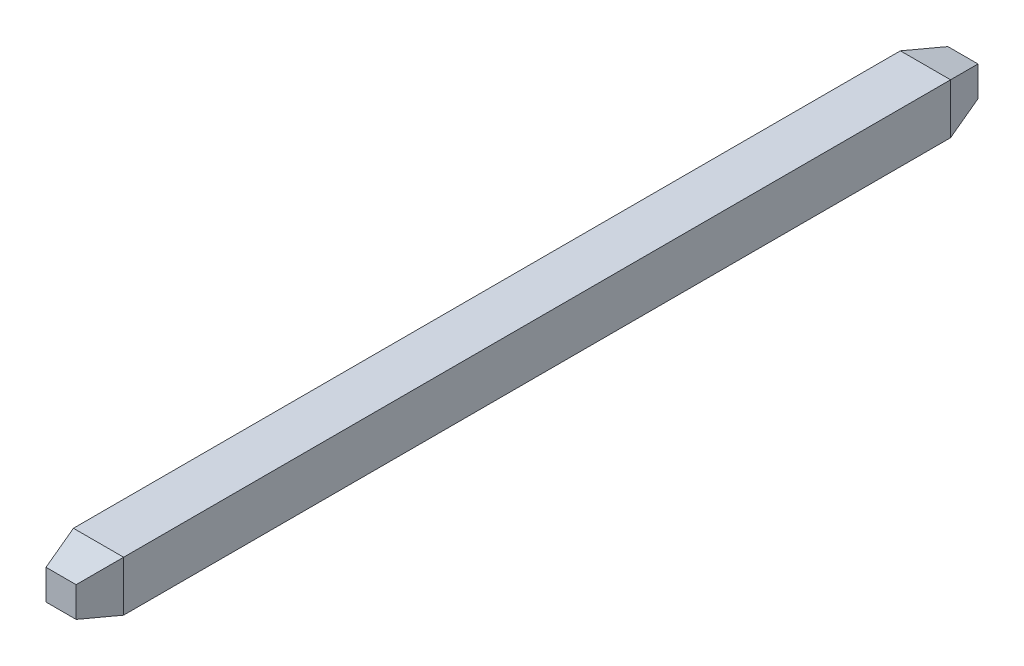
ISO-10303-21;
HEADER;
FILE_DESCRIPTION(('STEP AP214'),'2;1');
FILE_NAME('part.step','',(''),(''),'','','');
FILE_SCHEMA(('AUTOMOTIVE_DESIGN { 1 0 10303 214 1 1 1 1 }'));
ENDSEC;
DATA;
#1=APPLICATION_CONTEXT('core data for automotive mechanical design processes');
#2=APPLICATION_PROTOCOL_DEFINITION('international standard','automotive_design',2000,#1);
#3=PRODUCT_CONTEXT('',#1,'mechanical');
#4=PRODUCT('Part','Part','',(#3));
#5=PRODUCT_RELATED_PRODUCT_CATEGORY('part','',(#4));
#6=PRODUCT_DEFINITION_FORMATION('','',#4);
#7=PRODUCT_DEFINITION_CONTEXT('part definition',#1,'design');
#8=PRODUCT_DEFINITION('design','',#6,#7);
#9=PRODUCT_DEFINITION_SHAPE('','',#8);
#10=(LENGTH_UNIT() NAMED_UNIT(*) SI_UNIT(.MILLI.,.METRE.));
#11=(NAMED_UNIT(*) PLANE_ANGLE_UNIT() SI_UNIT($,.RADIAN.));
#12=(NAMED_UNIT(*) SI_UNIT($,.STERADIAN.) SOLID_ANGLE_UNIT());
#13=UNCERTAINTY_MEASURE_WITH_UNIT(LENGTH_MEASURE(1.E-05),#10,'distance_accuracy_value','');
#14=(GEOMETRIC_REPRESENTATION_CONTEXT(3) GLOBAL_UNCERTAINTY_ASSIGNED_CONTEXT((#13)) GLOBAL_UNIT_ASSIGNED_CONTEXT((#10,
#11,#12)) REPRESENTATION_CONTEXT('',''));
#15=CARTESIAN_POINT('',(0.,0.,0.));
#16=DIRECTION('',(0.,0.,1.));
#17=DIRECTION('',(1.,0.,0.));
#18=AXIS2_PLACEMENT_3D('',#15,#16,#17);
#19=CARTESIAN_POINT('',(0.32,-1.53140500673763,7.92229749663118));
#20=DIRECTION('',(0.965925826289069,0.,0.25881904510252));
#21=DIRECTION('',(0.,-1.,0.));
#22=AXIS2_PLACEMENT_3D('',#19,#20,#21);
#23=PLANE('',#22);
#24=DIRECTION('',(0.,1.,0.));
#25=VECTOR('',#24,1.);
#26=CARTESIAN_POINT('',(0.32,-0.32,7.92229749663118));
#27=LINE('',#26,#25);
#28=CARTESIAN_POINT('',(0.32,-0.32,7.92229749663118));
#29=VERTEX_POINT('',#28);
#30=CARTESIAN_POINT('',(0.32,0.32,7.92229749663118));
#31=VERTEX_POINT('',#30);
#32=EDGE_CURVE('E99',#29,#31,#27,.T.);
#33=ORIENTED_EDGE('',*,*,#32,.T.);
#34=DIRECTION('',(-0.250562807085731,-0.25056280708573,0.93511312653103));
#35=VECTOR('',#34,1.);
#36=CARTESIAN_POINT('',(0.32,0.32,7.92229749663118));
#37=LINE('',#36,#35);
#38=CARTESIAN_POINT('',(0.192,0.192,8.4));
#39=VERTEX_POINT('',#38);
#40=EDGE_CURVE('E179',#31,#39,#37,.T.);
#41=ORIENTED_EDGE('',*,*,#40,.T.);
#42=DIRECTION('',(0.,1.,0.));
#43=VECTOR('',#42,1.);
#44=CARTESIAN_POINT('',(0.192,-0.192,8.4));
#45=LINE('',#44,#43);
#46=CARTESIAN_POINT('',(0.192,-0.192,8.4));
#47=VERTEX_POINT('',#46);
#48=EDGE_CURVE('E102',#47,#39,#45,.T.);
#49=ORIENTED_EDGE('',*,*,#48,.F.);
#50=DIRECTION('',(-0.25056280708573,0.250562807085731,0.93511312653103));
#51=VECTOR('',#50,1.);
#52=CARTESIAN_POINT('',(0.32,-0.32,7.92229749663118));
#53=LINE('',#52,#51);
#54=EDGE_CURVE('E11',#29,#47,#53,.T.);
#55=ORIENTED_EDGE('',*,*,#54,.F.);
#56=EDGE_LOOP('',(#33,#41,#49,#55));
#57=FACE_BOUND('',#56,.T.);
#58=ADVANCED_FACE('F16',(#57),#23,.T.);
#59=CARTESIAN_POINT('',(-1.53140500673763,-0.32,7.92229749663118));
#60=DIRECTION('',(0.,-0.965925826289069,0.25881904510252));
#61=DIRECTION('',(-1.,0.,0.));
#62=AXIS2_PLACEMENT_3D('',#59,#60,#61);
#63=PLANE('',#62);
#64=DIRECTION('',(1.,0.,0.));
#65=VECTOR('',#64,1.);
#66=CARTESIAN_POINT('',(-0.32,-0.32,7.92229749663118));
#67=LINE('',#66,#65);
#68=CARTESIAN_POINT('',(-0.32,-0.32,7.92229749663118));
#69=VERTEX_POINT('',#68);
#70=EDGE_CURVE('E124',#69,#29,#67,.T.);
#71=ORIENTED_EDGE('',*,*,#70,.T.);
#72=ORIENTED_EDGE('',*,*,#54,.T.);
#73=DIRECTION('',(1.,0.,0.));
#74=VECTOR('',#73,1.);
#75=CARTESIAN_POINT('',(-0.192,-0.192,8.4));
#76=LINE('',#75,#74);
#77=CARTESIAN_POINT('',(-0.192,-0.192,8.4));
#78=VERTEX_POINT('',#77);
#79=EDGE_CURVE('E172',#78,#47,#76,.T.);
#80=ORIENTED_EDGE('',*,*,#79,.F.);
#81=DIRECTION('',(0.250562807085731,0.250562807085731,0.93511312653103));
#82=VECTOR('',#81,1.);
#83=CARTESIAN_POINT('',(-0.32,-0.32,7.92229749663118));
#84=LINE('',#83,#82);
#85=EDGE_CURVE('E20',#69,#78,#84,.T.);
#86=ORIENTED_EDGE('',*,*,#85,.F.);
#87=EDGE_LOOP('',(#71,#72,#80,#86));
#88=FACE_BOUND('',#87,.T.);
#89=ADVANCED_FACE('F130',(#88),#63,.T.);
#90=CARTESIAN_POINT('',(-0.32,1.53140500673763,7.92229749663118));
#91=DIRECTION('',(-0.965925826289069,0.,0.25881904510252));
#92=DIRECTION('',(0.,1.,0.));
#93=AXIS2_PLACEMENT_3D('',#90,#91,#92);
#94=PLANE('',#93);
#95=DIRECTION('',(0.,-1.,0.));
#96=VECTOR('',#95,1.);
#97=CARTESIAN_POINT('',(-0.32,0.32,7.92229749663118));
#98=LINE('',#97,#96);
#99=CARTESIAN_POINT('',(-0.32,0.32,7.92229749663118));
#100=VERTEX_POINT('',#99);
#101=EDGE_CURVE('E151',#100,#69,#98,.T.);
#102=ORIENTED_EDGE('',*,*,#101,.T.);
#103=ORIENTED_EDGE('',*,*,#85,.T.);
#104=DIRECTION('',(0.,-1.,0.));
#105=VECTOR('',#104,1.);
#106=CARTESIAN_POINT('',(-0.192,0.192,8.4));
#107=LINE('',#106,#105);
#108=CARTESIAN_POINT('',(-0.192,0.192,8.4));
#109=VERTEX_POINT('',#108);
#110=EDGE_CURVE('E161',#109,#78,#107,.T.);
#111=ORIENTED_EDGE('',*,*,#110,.F.);
#112=DIRECTION('',(0.250562807085731,-0.250562807085731,0.93511312653103));
#113=VECTOR('',#112,1.);
#114=CARTESIAN_POINT('',(-0.32,0.32,7.92229749663118));
#115=LINE('',#114,#113);
#116=EDGE_CURVE('E169',#100,#109,#115,.T.);
#117=ORIENTED_EDGE('',*,*,#116,.F.);
#118=EDGE_LOOP('',(#102,#103,#111,#117));
#119=FACE_BOUND('',#118,.T.);
#120=ADVANCED_FACE('F251',(#119),#94,.T.);
#121=CARTESIAN_POINT('',(1.53140500673763,0.32,7.92229749663118));
#122=DIRECTION('',(0.,0.965925826289069,0.25881904510252));
#123=DIRECTION('',(1.,0.,0.));
#124=AXIS2_PLACEMENT_3D('',#121,#122,#123);
#125=PLANE('',#124);
#126=DIRECTION('',(-1.,0.,0.));
#127=VECTOR('',#126,1.);
#128=CARTESIAN_POINT('',(0.32,0.32,7.92229749663118));
#129=LINE('',#128,#127);
#130=EDGE_CURVE('E211',#31,#100,#129,.T.);
#131=ORIENTED_EDGE('',*,*,#130,.T.);
#132=ORIENTED_EDGE('',*,*,#116,.T.);
#133=DIRECTION('',(-1.,0.,0.));
#134=VECTOR('',#133,1.);
#135=CARTESIAN_POINT('',(0.192,0.192,8.4));
#136=LINE('',#135,#134);
#137=EDGE_CURVE('E157',#39,#109,#136,.T.);
#138=ORIENTED_EDGE('',*,*,#137,.F.);
#139=ORIENTED_EDGE('',*,*,#40,.F.);
#140=EDGE_LOOP('',(#131,#132,#138,#139));
#141=FACE_BOUND('',#140,.T.);
#142=ADVANCED_FACE('F262',(#141),#125,.T.);
#143=CARTESIAN_POINT('',(0.32,-1.53140500673763,-2.62229749663118));
#144=DIRECTION('',(-0.965925826289068,0.,0.258819045102521));
#145=DIRECTION('',(0.,1.,0.));
#146=AXIS2_PLACEMENT_3D('',#143,#144,#145);
#147=PLANE('',#146);
#148=DIRECTION('',(0.,1.,0.));
#149=VECTOR('',#148,1.);
#150=CARTESIAN_POINT('',(0.32,-0.32,-2.62229749663118));
#151=LINE('',#150,#149);
#152=CARTESIAN_POINT('',(0.32,-0.32,-2.62229749663118));
#153=VERTEX_POINT('',#152);
#154=CARTESIAN_POINT('',(0.32,0.32,-2.62229749663118));
#155=VERTEX_POINT('',#154);
#156=EDGE_CURVE('E118',#153,#155,#151,.T.);
#157=ORIENTED_EDGE('',*,*,#156,.F.);
#158=DIRECTION('',(0.250562807085731,-0.250562807085732,0.93511312653103));
#159=VECTOR('',#158,1.);
#160=CARTESIAN_POINT('',(0.32,-0.32,-2.62229749663118));
#161=LINE('',#160,#159);
#162=CARTESIAN_POINT('',(0.192,-0.192,-3.1));
#163=VERTEX_POINT('',#162);
#164=EDGE_CURVE('E166',#163,#153,#161,.T.);
#165=ORIENTED_EDGE('',*,*,#164,.F.);
#166=DIRECTION('',(0.,1.,0.));
#167=VECTOR('',#166,1.);
#168=CARTESIAN_POINT('',(0.192,-0.192,-3.1));
#169=LINE('',#168,#167);
#170=CARTESIAN_POINT('',(0.192,0.192,-3.1));
#171=VERTEX_POINT('',#170);
#172=EDGE_CURVE('E144',#163,#171,#169,.T.);
#173=ORIENTED_EDGE('',*,*,#172,.T.);
#174=DIRECTION('',(0.250562807085731,0.250562807085731,0.93511312653103));
#175=VECTOR('',#174,1.);
#176=CARTESIAN_POINT('',(0.32,0.32,-2.62229749663118));
#177=LINE('',#176,#175);
#178=EDGE_CURVE('E164',#171,#155,#177,.T.);
#179=ORIENTED_EDGE('',*,*,#178,.T.);
#180=EDGE_LOOP('',(#157,#165,#173,#179));
#181=FACE_BOUND('',#180,.T.);
#182=ADVANCED_FACE('F231',(#181),#147,.F.);
#183=CARTESIAN_POINT('',(-1.53140500673763,-0.32,-2.62229749663118));
#184=DIRECTION('',(0.,0.965925826289068,0.258819045102521));
#185=DIRECTION('',(1.,0.,0.));
#186=AXIS2_PLACEMENT_3D('',#183,#184,#185);
#187=PLANE('',#186);
#188=DIRECTION('',(1.,0.,0.));
#189=VECTOR('',#188,1.);
#190=CARTESIAN_POINT('',(-0.32,-0.32,-2.62229749663118));
#191=LINE('',#190,#189);
#192=CARTESIAN_POINT('',(-0.32,-0.32,-2.62229749663118));
#193=VERTEX_POINT('',#192);
#194=EDGE_CURVE('E126',#193,#153,#191,.T.);
#195=ORIENTED_EDGE('',*,*,#194,.F.);
#196=DIRECTION('',(-0.250562807085731,-0.250562807085732,0.935113126531029));
#197=VECTOR('',#196,1.);
#198=CARTESIAN_POINT('',(-0.32,-0.32,-2.62229749663118));
#199=LINE('',#198,#197);
#200=CARTESIAN_POINT('',(-0.192,-0.192,-3.1));
#201=VERTEX_POINT('',#200);
#202=EDGE_CURVE('E39',#201,#193,#199,.T.);
#203=ORIENTED_EDGE('',*,*,#202,.F.);
#204=DIRECTION('',(1.,0.,0.));
#205=VECTOR('',#204,1.);
#206=CARTESIAN_POINT('',(-0.192,-0.192,-3.1));
#207=LINE('',#206,#205);
#208=EDGE_CURVE('E146',#201,#163,#207,.T.);
#209=ORIENTED_EDGE('',*,*,#208,.T.);
#210=ORIENTED_EDGE('',*,*,#164,.T.);
#211=EDGE_LOOP('',(#195,#203,#209,#210));
#212=FACE_BOUND('',#211,.T.);
#213=ADVANCED_FACE('F189',(#212),#187,.F.);
#214=CARTESIAN_POINT('',(-0.32,1.53140500673763,-2.62229749663118));
#215=DIRECTION('',(0.965925826289068,0.,0.258819045102521));
#216=DIRECTION('',(0.,-1.,0.));
#217=AXIS2_PLACEMENT_3D('',#214,#215,#216);
#218=PLANE('',#217);
#219=DIRECTION('',(0.,-1.,0.));
#220=VECTOR('',#219,1.);
#221=CARTESIAN_POINT('',(-0.32,0.32,-2.62229749663118));
#222=LINE('',#221,#220);
#223=CARTESIAN_POINT('',(-0.32,0.32,-2.62229749663118));
#224=VERTEX_POINT('',#223);
#225=EDGE_CURVE('E140',#224,#193,#222,.T.);
#226=ORIENTED_EDGE('',*,*,#225,.F.);
#227=DIRECTION('',(-0.250562807085732,0.250562807085732,0.935113126531029));
#228=VECTOR('',#227,1.);
#229=CARTESIAN_POINT('',(-0.32,0.32,-2.62229749663118));
#230=LINE('',#229,#228);
#231=CARTESIAN_POINT('',(-0.192,0.192,-3.1));
#232=VERTEX_POINT('',#231);
#233=EDGE_CURVE('E162',#232,#224,#230,.T.);
#234=ORIENTED_EDGE('',*,*,#233,.F.);
#235=DIRECTION('',(0.,-1.,0.));
#236=VECTOR('',#235,1.);
#237=CARTESIAN_POINT('',(-0.192,0.192,-3.1));
#238=LINE('',#237,#236);
#239=EDGE_CURVE('E148',#232,#201,#238,.T.);
#240=ORIENTED_EDGE('',*,*,#239,.T.);
#241=ORIENTED_EDGE('',*,*,#202,.T.);
#242=EDGE_LOOP('',(#226,#234,#240,#241));
#243=FACE_BOUND('',#242,.T.);
#244=ADVANCED_FACE('F185',(#243),#218,.F.);
#245=CARTESIAN_POINT('',(1.53140500673763,0.32,-2.62229749663118));
#246=DIRECTION('',(0.,-0.965925826289068,0.258819045102521));
#247=DIRECTION('',(-1.,0.,0.));
#248=AXIS2_PLACEMENT_3D('',#245,#246,#247);
#249=PLANE('',#248);
#250=DIRECTION('',(-1.,0.,0.));
#251=VECTOR('',#250,1.);
#252=CARTESIAN_POINT('',(0.32,0.32,-2.62229749663118));
#253=LINE('',#252,#251);
#254=EDGE_CURVE('E200',#155,#224,#253,.T.);
#255=ORIENTED_EDGE('',*,*,#254,.F.);
#256=ORIENTED_EDGE('',*,*,#178,.F.);
#257=DIRECTION('',(-1.,0.,0.));
#258=VECTOR('',#257,1.);
#259=CARTESIAN_POINT('',(0.192,0.192,-3.1));
#260=LINE('',#259,#258);
#261=EDGE_CURVE('E153',#171,#232,#260,.T.);
#262=ORIENTED_EDGE('',*,*,#261,.T.);
#263=ORIENTED_EDGE('',*,*,#233,.T.);
#264=EDGE_LOOP('',(#255,#256,#262,#263));
#265=FACE_BOUND('',#264,.T.);
#266=ADVANCED_FACE('F234',(#265),#249,.F.);
#267=CARTESIAN_POINT('',(0.,0.,-3.1));
#268=DIRECTION('',(0.,0.,1.));
#269=DIRECTION('',(1.,0.,0.));
#270=AXIS2_PLACEMENT_3D('',#267,#268,#269);
#271=PLANE('',#270);
#272=ORIENTED_EDGE('',*,*,#261,.F.);
#273=ORIENTED_EDGE('',*,*,#172,.F.);
#274=ORIENTED_EDGE('',*,*,#208,.F.);
#275=ORIENTED_EDGE('',*,*,#239,.F.);
#276=EDGE_LOOP('',(#272,#273,#274,#275));
#277=FACE_BOUND('',#276,.T.);
#278=ADVANCED_FACE('F233',(#277),#271,.F.);
#279=CARTESIAN_POINT('',(0.,0.,8.4));
#280=DIRECTION('',(0.,0.,1.));
#281=DIRECTION('',(1.,0.,0.));
#282=AXIS2_PLACEMENT_3D('',#279,#280,#281);
#283=PLANE('',#282);
#284=ORIENTED_EDGE('',*,*,#137,.T.);
#285=ORIENTED_EDGE('',*,*,#110,.T.);
#286=ORIENTED_EDGE('',*,*,#79,.T.);
#287=ORIENTED_EDGE('',*,*,#48,.T.);
#288=EDGE_LOOP('',(#284,#285,#286,#287));
#289=FACE_BOUND('',#288,.T.);
#290=ADVANCED_FACE('F242',(#289),#283,.T.);
#291=CARTESIAN_POINT('',(0.32,-0.32,-3.1));
#292=DIRECTION('',(1.,0.,0.));
#293=DIRECTION('',(0.,1.,0.));
#294=AXIS2_PLACEMENT_3D('',#291,#292,#293);
#295=PLANE('',#294);
#296=ORIENTED_EDGE('',*,*,#32,.F.);
#297=DIRECTION('',(0.,0.,1.));
#298=VECTOR('',#297,1.);
#299=CARTESIAN_POINT('',(0.32,-0.32,-2.62229749663118));
#300=LINE('',#299,#298);
#301=EDGE_CURVE('E112',#153,#29,#300,.T.);
#302=ORIENTED_EDGE('',*,*,#301,.F.);
#303=ORIENTED_EDGE('',*,*,#156,.T.);
#304=DIRECTION('',(0.,0.,1.));
#305=VECTOR('',#304,1.);
#306=CARTESIAN_POINT('',(0.32,0.32,-2.62229749663118));
#307=LINE('',#306,#305);
#308=EDGE_CURVE('E115',#155,#31,#307,.T.);
#309=ORIENTED_EDGE('',*,*,#308,.T.);
#310=EDGE_LOOP('',(#296,#302,#303,#309));
#311=FACE_BOUND('',#310,.T.);
#312=ADVANCED_FACE('F110',(#311),#295,.T.);
#313=CARTESIAN_POINT('',(-0.32,-0.32,-3.1));
#314=DIRECTION('',(0.,-1.,0.));
#315=DIRECTION('',(0.,0.,-1.));
#316=AXIS2_PLACEMENT_3D('',#313,#314,#315);
#317=PLANE('',#316);
#318=ORIENTED_EDGE('',*,*,#70,.F.);
#319=DIRECTION('',(0.,0.,1.));
#320=VECTOR('',#319,1.);
#321=CARTESIAN_POINT('',(-0.32,-0.32,-2.62229749663118));
#322=LINE('',#321,#320);
#323=EDGE_CURVE('E132',#193,#69,#322,.T.);
#324=ORIENTED_EDGE('',*,*,#323,.F.);
#325=ORIENTED_EDGE('',*,*,#194,.T.);
#326=ORIENTED_EDGE('',*,*,#301,.T.);
#327=EDGE_LOOP('',(#318,#324,#325,#326));
#328=FACE_BOUND('',#327,.T.);
#329=ADVANCED_FACE('F122',(#328),#317,.T.);
#330=CARTESIAN_POINT('',(-0.32,0.32,-3.1));
#331=DIRECTION('',(-1.,0.,0.));
#332=DIRECTION('',(0.,1.,0.));
#333=AXIS2_PLACEMENT_3D('',#330,#331,#332);
#334=PLANE('',#333);
#335=ORIENTED_EDGE('',*,*,#101,.F.);
#336=DIRECTION('',(0.,0.,1.));
#337=VECTOR('',#336,1.);
#338=CARTESIAN_POINT('',(-0.32,0.32,-2.62229749663118));
#339=LINE('',#338,#337);
#340=EDGE_CURVE('E195',#224,#100,#339,.T.);
#341=ORIENTED_EDGE('',*,*,#340,.F.);
#342=ORIENTED_EDGE('',*,*,#225,.T.);
#343=ORIENTED_EDGE('',*,*,#323,.T.);
#344=EDGE_LOOP('',(#335,#341,#342,#343));
#345=FACE_BOUND('',#344,.T.);
#346=ADVANCED_FACE('F18',(#345),#334,.T.);
#347=CARTESIAN_POINT('',(0.32,0.32,-3.1));
#348=DIRECTION('',(0.,1.,0.));
#349=DIRECTION('',(1.,0.,0.));
#350=AXIS2_PLACEMENT_3D('',#347,#348,#349);
#351=PLANE('',#350);
#352=ORIENTED_EDGE('',*,*,#130,.F.);
#353=ORIENTED_EDGE('',*,*,#308,.F.);
#354=ORIENTED_EDGE('',*,*,#254,.T.);
#355=ORIENTED_EDGE('',*,*,#340,.T.);
#356=EDGE_LOOP('',(#352,#353,#354,#355));
#357=FACE_BOUND('',#356,.T.);
#358=ADVANCED_FACE('F203',(#357),#351,.T.);
#359=CLOSED_SHELL('',(#58,#89,#120,#142,#182,#213,#244,#266,#278,#290,#312,#329,#346,#358));
#360=MANIFOLD_SOLID_BREP('B1',#359);
#361=ADVANCED_BREP_SHAPE_REPRESENTATION('',(#18,#360),#14);
#362=SHAPE_DEFINITION_REPRESENTATION(#9,#361);
ENDSEC;
END-ISO-10303-21;
